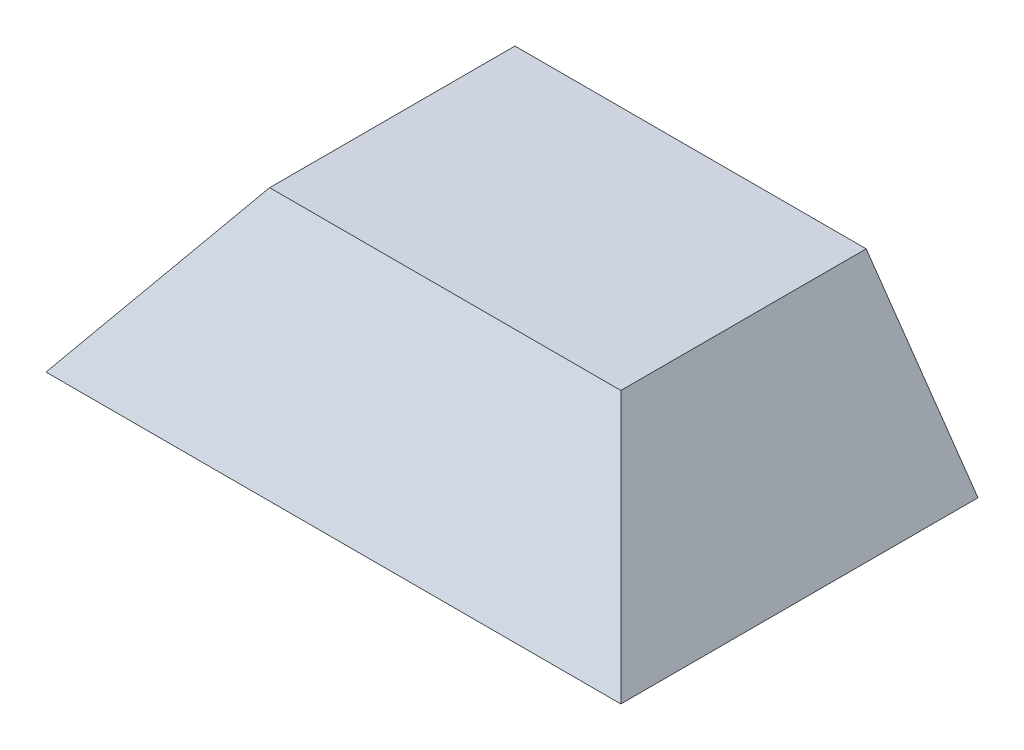
ISO-10303-21;
HEADER;
FILE_DESCRIPTION(('STEP AP214'),'2;1');
FILE_NAME('part.step','',(''),(''),'','','');
FILE_SCHEMA(('AUTOMOTIVE_DESIGN { 1 0 10303 214 1 1 1 1 }'));
ENDSEC;
DATA;
#1=APPLICATION_CONTEXT('core data for automotive mechanical design processes');
#2=APPLICATION_PROTOCOL_DEFINITION('international standard','automotive_design',2000,#1);
#3=PRODUCT_CONTEXT('',#1,'mechanical');
#4=PRODUCT('Part','Part','',(#3));
#5=PRODUCT_RELATED_PRODUCT_CATEGORY('part','',(#4));
#6=PRODUCT_DEFINITION_FORMATION('','',#4);
#7=PRODUCT_DEFINITION_CONTEXT('part definition',#1,'design');
#8=PRODUCT_DEFINITION('design','',#6,#7);
#9=PRODUCT_DEFINITION_SHAPE('','',#8);
#10=(LENGTH_UNIT() NAMED_UNIT(*) SI_UNIT(.MILLI.,.METRE.));
#11=(NAMED_UNIT(*) PLANE_ANGLE_UNIT() SI_UNIT($,.RADIAN.));
#12=(NAMED_UNIT(*) SI_UNIT($,.STERADIAN.) SOLID_ANGLE_UNIT());
#13=UNCERTAINTY_MEASURE_WITH_UNIT(LENGTH_MEASURE(1.E-05),#10,'distance_accuracy_value','');
#14=(GEOMETRIC_REPRESENTATION_CONTEXT(3) GLOBAL_UNCERTAINTY_ASSIGNED_CONTEXT((#13)) GLOBAL_UNIT_ASSIGNED_CONTEXT((#10,
#11,#12)) REPRESENTATION_CONTEXT('',''));
#15=CARTESIAN_POINT('',(0.,0.,0.));
#16=DIRECTION('',(0.,0.,1.));
#17=DIRECTION('',(1.,0.,0.));
#18=AXIS2_PLACEMENT_3D('',#15,#16,#17);
#19=CARTESIAN_POINT('',(-70.,0.,0.));
#20=DIRECTION('',(-1.,0.,0.));
#21=DIRECTION('',(0.,0.,-1.));
#22=AXIS2_PLACEMENT_3D('',#19,#20,#21);
#23=PLANE('',#22);
#24=DIRECTION('',(0.,0.,1.));
#25=VECTOR('',#24,1.);
#26=CARTESIAN_POINT('',(-70.,5.,-8.29628070749418));
#27=LINE('',#26,#25);
#28=CARTESIAN_POINT('',(-70.,5.,-8.29628070749418));
#29=VERTEX_POINT('',#28);
#30=CARTESIAN_POINT('',(-70.,5.,11.7037192925058));
#31=VERTEX_POINT('',#30);
#32=EDGE_CURVE('E238',#29,#31,#27,.T.);
#33=ORIENTED_EDGE('',*,*,#32,.T.);
#34=DIRECTION('',(0.,-1.,0.));
#35=VECTOR('',#34,1.);
#36=CARTESIAN_POINT('',(-70.,0.,11.7037192925058));
#37=LINE('',#36,#35);
#38=CARTESIAN_POINT('',(-70.,0.,11.7037192925058));
#39=VERTEX_POINT('',#38);
#40=EDGE_CURVE('E253',#31,#39,#37,.T.);
#41=ORIENTED_EDGE('',*,*,#40,.T.);
#42=DIRECTION('',(0.,0.,-1.));
#43=VECTOR('',#42,1.);
#44=CARTESIAN_POINT('',(-70.,0.,-8.29628070749418));
#45=LINE('',#44,#43);
#46=CARTESIAN_POINT('',(-70.,0.,-8.29628070749418));
#47=VERTEX_POINT('',#46);
#48=EDGE_CURVE('E257',#39,#47,#45,.T.);
#49=ORIENTED_EDGE('',*,*,#48,.T.);
#50=DIRECTION('',(0.,1.,0.));
#51=VECTOR('',#50,1.);
#52=CARTESIAN_POINT('',(-70.,0.,-8.29628070749418));
#53=LINE('',#52,#51);
#54=EDGE_CURVE('E254',#47,#29,#53,.T.);
#55=ORIENTED_EDGE('',*,*,#54,.T.);
#56=EDGE_LOOP('',(#33,#41,#49,#55));
#57=FACE_BOUND('',#56,.T.);
#58=ADVANCED_FACE('F41',(#57),#23,.F.);
#59=DIRECTION('',(0.,0.,-1.));
#60=VECTOR('',#59,1.);
#61=CARTESIAN_POINT('',(-70.,10.,-8.29628070749418));
#62=LINE('',#61,#60);
#63=CARTESIAN_POINT('',(-70.,10.,11.7037192925058));
#64=VERTEX_POINT('',#63);
#65=CARTESIAN_POINT('',(-70.,10.,-8.29628070749418));
#66=VERTEX_POINT('',#65);
#67=EDGE_CURVE('E582',#64,#66,#62,.T.);
#68=ORIENTED_EDGE('',*,*,#67,.T.);
#69=CARTESIAN_POINT('',(-70.,20.,-8.29628070749418));
#70=VERTEX_POINT('',#69);
#71=EDGE_CURVE('E243',#66,#70,#53,.T.);
#72=ORIENTED_EDGE('',*,*,#71,.T.);
#73=DIRECTION('',(0.,0.,1.));
#74=VECTOR('',#73,1.);
#75=CARTESIAN_POINT('',(-70.,20.,-8.29628070749418));
#76=LINE('',#75,#74);
#77=CARTESIAN_POINT('',(-70.,20.,11.7037192925058));
#78=VERTEX_POINT('',#77);
#79=EDGE_CURVE('E250',#70,#78,#76,.T.);
#80=ORIENTED_EDGE('',*,*,#79,.T.);
#81=EDGE_CURVE('E261',#78,#64,#37,.T.);
#82=ORIENTED_EDGE('',*,*,#81,.T.);
#83=EDGE_LOOP('',(#68,#72,#80,#82));
#84=FACE_BOUND('',#83,.T.);
#85=ADVANCED_FACE('F494',(#84),#23,.F.);
#86=CARTESIAN_POINT('',(-90.002,0.,11.7037192925058));
#87=DIRECTION('',(0.,0.,1.));
#88=DIRECTION('',(1.,0.,0.));
#89=AXIS2_PLACEMENT_3D('',#86,#87,#88);
#90=PLANE('',#89);
#91=ORIENTED_EDGE('',*,*,#40,.F.);
#92=DIRECTION('',(1.,0.,0.));
#93=VECTOR('',#92,1.);
#94=CARTESIAN_POINT('',(-78.,5.,11.7037192925058));
#95=LINE('',#94,#93);
#96=CARTESIAN_POINT('',(-78.,5.,11.7037192925058));
#97=VERTEX_POINT('',#96);
#98=EDGE_CURVE('E245',#97,#31,#95,.T.);
#99=ORIENTED_EDGE('',*,*,#98,.F.);
#100=DIRECTION('',(0.,1.,0.));
#101=VECTOR('',#100,1.);
#102=CARTESIAN_POINT('',(-78.,10.,11.7037192925058));
#103=LINE('',#102,#101);
#104=CARTESIAN_POINT('',(-78.,10.,11.7037192925058));
#105=VERTEX_POINT('',#104);
#106=EDGE_CURVE('E231',#97,#105,#103,.T.);
#107=ORIENTED_EDGE('',*,*,#106,.T.);
#108=DIRECTION('',(1.,0.,0.));
#109=VECTOR('',#108,1.);
#110=CARTESIAN_POINT('',(-78.,10.,11.7037192925058));
#111=LINE('',#110,#109);
#112=EDGE_CURVE('E227',#105,#64,#111,.T.);
#113=ORIENTED_EDGE('',*,*,#112,.T.);
#114=ORIENTED_EDGE('',*,*,#81,.F.);
#115=DIRECTION('',(1.,0.,0.));
#116=VECTOR('',#115,1.);
#117=CARTESIAN_POINT('',(-90.002,20.,11.7037192925058));
#118=LINE('',#117,#116);
#119=CARTESIAN_POINT('',(-71.1127508807601,20.,11.7037192925058));
#120=VERTEX_POINT('',#119);
#121=EDGE_CURVE('E265',#120,#78,#118,.T.);
#122=ORIENTED_EDGE('',*,*,#121,.F.);
#123=DIRECTION('',(-0.573576436351041,-0.819152044288995,0.));
#124=VECTOR('',#123,1.);
#125=CARTESIAN_POINT('',(-86.7240498027007,-2.29524543802495,11.7037192925058));
#126=LINE('',#125,#124);
#127=CARTESIAN_POINT('',(-85.1169016449542,0.,11.7037192925058));
#128=VERTEX_POINT('',#127);
#129=EDGE_CURVE('E272',#120,#128,#126,.T.);
#130=ORIENTED_EDGE('',*,*,#129,.T.);
#131=DIRECTION('',(1.,0.,0.));
#132=VECTOR('',#131,1.);
#133=CARTESIAN_POINT('',(-90.002,0.,11.7037192925058));
#134=LINE('',#133,#132);
#135=EDGE_CURVE('E64',#128,#39,#134,.T.);
#136=ORIENTED_EDGE('',*,*,#135,.T.);
#137=EDGE_LOOP('',(#91,#99,#107,#113,#114,#122,#130,#136));
#138=FACE_BOUND('',#137,.T.);
#139=ADVANCED_FACE('F500',(#138),#90,.T.);
#140=CARTESIAN_POINT('',(-90.002,0.,-8.29628070749418));
#141=DIRECTION('',(0.,0.,-1.));
#142=DIRECTION('',(-1.,0.,0.));
#143=AXIS2_PLACEMENT_3D('',#140,#141,#142);
#144=PLANE('',#143);
#145=DIRECTION('',(0.,-1.,0.));
#146=VECTOR('',#145,1.);
#147=CARTESIAN_POINT('',(-78.,10.,-8.29628070749418));
#148=LINE('',#147,#146);
#149=CARTESIAN_POINT('',(-78.,10.,-8.29628070749418));
#150=VERTEX_POINT('',#149);
#151=CARTESIAN_POINT('',(-78.,5.,-8.29628070749418));
#152=VERTEX_POINT('',#151);
#153=EDGE_CURVE('E232',#150,#152,#148,.T.);
#154=ORIENTED_EDGE('',*,*,#153,.T.);
#155=DIRECTION('',(1.,0.,0.));
#156=VECTOR('',#155,1.);
#157=CARTESIAN_POINT('',(-78.,5.,-8.29628070749418));
#158=LINE('',#157,#156);
#159=EDGE_CURVE('E56',#152,#29,#158,.T.);
#160=ORIENTED_EDGE('',*,*,#159,.T.);
#161=ORIENTED_EDGE('',*,*,#54,.F.);
#162=DIRECTION('',(1.,0.,0.));
#163=VECTOR('',#162,1.);
#164=CARTESIAN_POINT('',(-90.002,0.,-8.29628070749418));
#165=LINE('',#164,#163);
#166=CARTESIAN_POINT('',(-85.1169016449542,0.,-8.29628070749418));
#167=VERTEX_POINT('',#166);
#168=EDGE_CURVE('E268',#167,#47,#165,.T.);
#169=ORIENTED_EDGE('',*,*,#168,.F.);
#170=DIRECTION('',(0.573576436351041,0.819152044288995,0.));
#171=VECTOR('',#170,1.);
#172=CARTESIAN_POINT('',(-86.7240498027006,-2.29524543802495,-8.29628070749418));
#173=LINE('',#172,#171);
#174=CARTESIAN_POINT('',(-71.1127508807601,20.,-8.29628070749418));
#175=VERTEX_POINT('',#174);
#176=EDGE_CURVE('E274',#167,#175,#173,.T.);
#177=ORIENTED_EDGE('',*,*,#176,.T.);
#178=DIRECTION('',(1.,0.,0.));
#179=VECTOR('',#178,1.);
#180=CARTESIAN_POINT('',(-90.002,20.,-8.29628070749418));
#181=LINE('',#180,#179);
#182=EDGE_CURVE('E260',#175,#70,#181,.T.);
#183=ORIENTED_EDGE('',*,*,#182,.T.);
#184=ORIENTED_EDGE('',*,*,#71,.F.);
#185=DIRECTION('',(1.,0.,0.));
#186=VECTOR('',#185,1.);
#187=CARTESIAN_POINT('',(-78.,10.,-8.29628070749418));
#188=LINE('',#187,#186);
#189=EDGE_CURVE('E224',#150,#66,#188,.T.);
#190=ORIENTED_EDGE('',*,*,#189,.F.);
#191=EDGE_LOOP('',(#154,#160,#161,#169,#177,#183,#184,#190));
#192=FACE_BOUND('',#191,.T.);
#193=ADVANCED_FACE('F241',(#192),#144,.T.);
#194=CARTESIAN_POINT('',(70.,0.,0.));
#195=DIRECTION('',(1.,0.,0.));
#196=DIRECTION('',(0.,0.,-1.));
#197=AXIS2_PLACEMENT_3D('',#194,#195,#196);
#198=PLANE('',#197);
#199=DIRECTION('',(0.,1.,0.));
#200=VECTOR('',#199,1.);
#201=CARTESIAN_POINT('',(70.,0.,-8.29628070749418));
#202=LINE('',#201,#200);
#203=CARTESIAN_POINT('',(70.,10.,-8.29628070749418));
#204=VERTEX_POINT('',#203);
#205=CARTESIAN_POINT('',(70.,20.,-8.29628070749418));
#206=VERTEX_POINT('',#205);
#207=EDGE_CURVE('E300',#204,#206,#202,.T.);
#208=ORIENTED_EDGE('',*,*,#207,.F.);
#209=DIRECTION('',(0.,0.,-1.));
#210=VECTOR('',#209,1.);
#211=CARTESIAN_POINT('',(70.,10.,-8.29628070749418));
#212=LINE('',#211,#210);
#213=CARTESIAN_POINT('',(70.,10.,11.7037192925058));
#214=VERTEX_POINT('',#213);
#215=EDGE_CURVE('E287',#214,#204,#212,.T.);
#216=ORIENTED_EDGE('',*,*,#215,.F.);
#217=DIRECTION('',(0.,-1.,0.));
#218=VECTOR('',#217,1.);
#219=CARTESIAN_POINT('',(70.,0.,11.7037192925058));
#220=LINE('',#219,#218);
#221=CARTESIAN_POINT('',(70.,20.,11.7037192925058));
#222=VERTEX_POINT('',#221);
#223=EDGE_CURVE('E318',#222,#214,#220,.T.);
#224=ORIENTED_EDGE('',*,*,#223,.F.);
#225=DIRECTION('',(0.,0.,1.));
#226=VECTOR('',#225,1.);
#227=CARTESIAN_POINT('',(70.,20.,-8.29628070749418));
#228=LINE('',#227,#226);
#229=EDGE_CURVE('E307',#206,#222,#228,.T.);
#230=ORIENTED_EDGE('',*,*,#229,.F.);
#231=EDGE_LOOP('',(#208,#216,#224,#230));
#232=FACE_BOUND('',#231,.T.);
#233=ADVANCED_FACE('F482',(#232),#198,.F.);
#234=CARTESIAN_POINT('',(86.723391822844,-2.29430574540416,-64.666));
#235=DIRECTION('',(-0.819152044288995,-0.573576436351041,0.));
#236=DIRECTION('',(0.573576436351041,-0.819152044288995,0.));
#237=AXIS2_PLACEMENT_3D('',#234,#235,#236);
#238=PLANE('',#237);
#239=DIRECTION('',(0.573576436351041,-0.819152044288995,0.));
#240=VECTOR('',#239,1.);
#241=CARTESIAN_POINT('',(86.723391822844,-2.29430574540416,0.));
#242=LINE('',#241,#240);
#243=CARTESIAN_POINT('',(52.9073548873079,46.,0.));
#244=VERTEX_POINT('',#243);
#245=CARTESIAN_POINT('',(71.1127508807601,20.,0.));
#246=VERTEX_POINT('',#245);
#247=EDGE_CURVE('E375',#244,#246,#242,.T.);
#248=ORIENTED_EDGE('',*,*,#247,.T.);
#249=DIRECTION('',(0.,0.,-1.));
#250=VECTOR('',#249,1.);
#251=CARTESIAN_POINT('',(71.1127508807601,20.,-8.29628070749418));
#252=LINE('',#251,#250);
#253=CARTESIAN_POINT('',(71.1127508807601,20.,11.7037192925058));
#254=VERTEX_POINT('',#253);
#255=EDGE_CURVE('E333',#254,#246,#252,.T.);
#256=ORIENTED_EDGE('',*,*,#255,.F.);
#257=DIRECTION('',(-0.573576436351041,0.819152044288995,0.));
#258=VECTOR('',#257,1.);
#259=CARTESIAN_POINT('',(86.7240498027007,-2.29524543802498,11.7037192925058));
#260=LINE('',#259,#258);
#261=CARTESIAN_POINT('',(85.1169016449542,0.,11.7037192925058));
#262=VERTEX_POINT('',#261);
#263=EDGE_CURVE('E324',#262,#254,#260,.T.);
#264=ORIENTED_EDGE('',*,*,#263,.F.);
#265=DIRECTION('',(0.,0.,-1.));
#266=VECTOR('',#265,1.);
#267=CARTESIAN_POINT('',(85.1169016449542,0.,-64.666));
#268=LINE('',#267,#266);
#269=CARTESIAN_POINT('',(85.1169016449542,0.,59.7819016449542));
#270=VERTEX_POINT('',#269);
#271=EDGE_CURVE('E392',#270,#262,#268,.T.);
#272=ORIENTED_EDGE('',*,*,#271,.F.);
#273=DIRECTION('',(0.49754281216452,-0.710564775461634,0.49754281216452));
#274=VECTOR('',#273,1.);
#275=CARTESIAN_POINT('',(87.5347599576417,-3.45305952984959,62.1997599576417));
#276=LINE('',#275,#274);
#277=CARTESIAN_POINT('',(52.9073548873079,46.,27.5723548873079));
#278=VERTEX_POINT('',#277);
#279=EDGE_CURVE('E381',#278,#270,#276,.T.);
#280=ORIENTED_EDGE('',*,*,#279,.F.);
#281=DIRECTION('',(0.,0.,1.));
#282=VECTOR('',#281,1.);
#283=CARTESIAN_POINT('',(52.9073548873079,46.,0.));
#284=LINE('',#283,#282);
#285=EDGE_CURVE('E385',#244,#278,#284,.T.);
#286=ORIENTED_EDGE('',*,*,#285,.F.);
#287=EDGE_LOOP('',(#248,#256,#264,#272,#280,#286));
#288=FACE_BOUND('',#287,.T.);
#289=ADVANCED_FACE('F480',(#288),#238,.T.);
#290=CARTESIAN_POINT('',(0.,0.,0.));
#291=DIRECTION('',(0.,0.,1.));
#292=DIRECTION('',(1.,0.,0.));
#293=AXIS2_PLACEMENT_3D('',#290,#291,#292);
#294=PLANE('',#293);
#295=DIRECTION('',(-1.,0.,0.));
#296=VECTOR('',#295,1.);
#297=CARTESIAN_POINT('',(90.002,20.,0.));
#298=LINE('',#297,#296);
#299=CARTESIAN_POINT('',(71.1364284841101,20.,0.));
#300=VERTEX_POINT('',#299);
#301=EDGE_CURVE('E337',#300,#246,#298,.T.);
#302=ORIENTED_EDGE('',*,*,#301,.T.);
#303=ORIENTED_EDGE('',*,*,#247,.F.);
#304=DIRECTION('',(-1.,0.,0.));
#305=VECTOR('',#304,1.);
#306=CARTESIAN_POINT('',(0.,46.,0.));
#307=LINE('',#306,#305);
#308=CARTESIAN_POINT('',(-52.9073548873079,46.,0.));
#309=VERTEX_POINT('',#308);
#310=EDGE_CURVE('E369',#244,#309,#307,.T.);
#311=ORIENTED_EDGE('',*,*,#310,.T.);
#312=DIRECTION('',(-0.573576436351041,-0.819152044288995,0.));
#313=VECTOR('',#312,1.);
#314=CARTESIAN_POINT('',(-85.1169016449542,0.,0.));
#315=LINE('',#314,#313);
#316=CARTESIAN_POINT('',(-52.8799125800155,46.0391916764601,0.));
#317=VERTEX_POINT('',#316);
#318=EDGE_CURVE('E363',#317,#309,#315,.T.);
#319=ORIENTED_EDGE('',*,*,#318,.F.);
#320=DIRECTION('',(-1.,0.,0.));
#321=VECTOR('',#320,1.);
#322=CARTESIAN_POINT('',(-52.8799125800155,46.0391916764601,0.));
#323=LINE('',#322,#321);
#324=CARTESIAN_POINT('',(52.9344174659689,46.0391916764601,0.));
#325=VERTEX_POINT('',#324);
#326=EDGE_CURVE('E360',#325,#317,#323,.T.);
#327=ORIENTED_EDGE('',*,*,#326,.F.);
#328=DIRECTION('',(-0.572925162497542,0.819607685528366,0.));
#329=VECTOR('',#328,1.);
#330=CARTESIAN_POINT('',(52.9344174659689,46.0391916764601,0.));
#331=LINE('',#330,#329);
#332=EDGE_CURVE('E358',#300,#325,#331,.T.);
#333=ORIENTED_EDGE('',*,*,#332,.F.);
#334=EDGE_LOOP('',(#302,#303,#311,#319,#327,#333));
#335=FACE_BOUND('',#334,.T.);
#336=ADVANCED_FACE('F441',(#335),#294,.F.);
#337=CARTESIAN_POINT('',(52.9344174659689,46.0391916764601,-278.925746661805));
#338=DIRECTION('',(0.819607685528366,0.572925162497542,0.));
#339=DIRECTION('',(-0.572925162497542,0.819607685528366,0.));
#340=AXIS2_PLACEMENT_3D('',#337,#338,#339);
#341=PLANE('',#340);
#342=DIRECTION('',(0.,0.,1.));
#343=VECTOR('',#342,1.);
#344=CARTESIAN_POINT('',(71.1364284841101,20.,-8.29628070749418));
#345=LINE('',#344,#343);
#346=CARTESIAN_POINT('',(71.1364284841101,20.,-8.29628070749416));
#347=VERTEX_POINT('',#346);
#348=EDGE_CURVE('E340',#347,#300,#345,.T.);
#349=ORIENTED_EDGE('',*,*,#348,.T.);
#350=ORIENTED_EDGE('',*,*,#332,.T.);
#351=DIRECTION('',(0.,0.,1.));
#352=VECTOR('',#351,1.);
#353=CARTESIAN_POINT('',(52.9344174659689,46.0391916764601,-278.925746661805));
#354=LINE('',#353,#352);
#355=CARTESIAN_POINT('',(52.9344174659689,46.0391916764601,-47.1598115447574));
#356=VERTEX_POINT('',#355);
#357=EDGE_CURVE('E370',#356,#325,#354,.T.);
#358=ORIENTED_EDGE('',*,*,#357,.F.);
#359=DIRECTION('',(0.572925162497542,-0.819607685528366,0.));
#360=VECTOR('',#359,1.);
#361=CARTESIAN_POINT('',(52.9344174659689,46.0391916764601,-47.1598115447574));
#362=LINE('',#361,#360);
#363=CARTESIAN_POINT('',(85.1169016449541,0.,-47.1598115447574));
#364=VERTEX_POINT('',#363);
#365=EDGE_CURVE('E350',#356,#364,#362,.T.);
#366=ORIENTED_EDGE('',*,*,#365,.T.);
#367=DIRECTION('',(0.,0.,1.));
#368=VECTOR('',#367,1.);
#369=CARTESIAN_POINT('',(85.1169016449542,0.,-278.925746661805));
#370=LINE('',#369,#368);
#371=CARTESIAN_POINT('',(85.1169016449542,0.,-8.29628070749422));
#372=VERTEX_POINT('',#371);
#373=EDGE_CURVE('E366',#364,#372,#370,.T.);
#374=ORIENTED_EDGE('',*,*,#373,.T.);
#375=DIRECTION('',(-0.572925162497542,0.819607685528366,0.));
#376=VECTOR('',#375,1.);
#377=CARTESIAN_POINT('',(86.7204021656378,-2.29391452239925,-8.29628070749418));
#378=LINE('',#377,#376);
#379=EDGE_CURVE('E336',#372,#347,#378,.T.);
#380=ORIENTED_EDGE('',*,*,#379,.T.);
#381=EDGE_LOOP('',(#349,#350,#358,#366,#374,#380));
#382=FACE_BOUND('',#381,.T.);
#383=ADVANCED_FACE('F432',(#382),#341,.F.);
#384=CARTESIAN_POINT('',(0.,46.,0.));
#385=DIRECTION('',(0.,1.,0.));
#386=DIRECTION('',(0.,0.,1.));
#387=AXIS2_PLACEMENT_3D('',#384,#385,#386);
#388=PLANE('',#387);
#389=ORIENTED_EDGE('',*,*,#310,.F.);
#390=ORIENTED_EDGE('',*,*,#285,.T.);
#391=DIRECTION('',(-1.,0.,0.));
#392=VECTOR('',#391,1.);
#393=CARTESIAN_POINT('',(90.001,46.,27.5723548873079));
#394=LINE('',#393,#392);
#395=CARTESIAN_POINT('',(-52.9073548873079,46.,27.5723548873079));
#396=VERTEX_POINT('',#395);
#397=EDGE_CURVE('E382',#278,#396,#394,.T.);
#398=ORIENTED_EDGE('',*,*,#397,.T.);
#399=DIRECTION('',(0.,0.,1.));
#400=VECTOR('',#399,1.);
#401=CARTESIAN_POINT('',(-52.9073548873079,46.,0.));
#402=LINE('',#401,#400);
#403=EDGE_CURVE('E379',#309,#396,#402,.T.);
#404=ORIENTED_EDGE('',*,*,#403,.F.);
#405=EDGE_LOOP('',(#389,#390,#398,#404));
#406=FACE_BOUND('',#405,.T.);
#407=ADVANCED_FACE('F450',(#406),#388,.F.);
#408=CARTESIAN_POINT('',(-86.723391822844,-2.29430574540416,-64.666));
#409=DIRECTION('',(-0.819152044288995,0.573576436351041,0.));
#410=DIRECTION('',(-0.573576436351041,-0.819152044288995,0.));
#411=AXIS2_PLACEMENT_3D('',#408,#409,#410);
#412=PLANE('',#411);
#413=DIRECTION('',(0.,0.,1.));
#414=VECTOR('',#413,1.);
#415=CARTESIAN_POINT('',(-85.1169016449542,0.,0.));
#416=LINE('',#415,#414);
#417=CARTESIAN_POINT('',(-85.1169016449542,0.,59.7819016449542));
#418=VERTEX_POINT('',#417);
#419=EDGE_CURVE('E387',#128,#418,#416,.T.);
#420=ORIENTED_EDGE('',*,*,#419,.F.);
#421=ORIENTED_EDGE('',*,*,#129,.F.);
#422=DIRECTION('',(0.,0.,1.));
#423=VECTOR('',#422,1.);
#424=CARTESIAN_POINT('',(-71.1127508807601,20.,-8.29628070749418));
#425=LINE('',#424,#423);
#426=EDGE_CURVE('E270',#175,#120,#425,.T.);
#427=ORIENTED_EDGE('',*,*,#426,.F.);
#428=ORIENTED_EDGE('',*,*,#176,.F.);
#429=CARTESIAN_POINT('',(-85.1169016449542,0.,-47.1598115447574));
#430=VERTEX_POINT('',#429);
#431=EDGE_CURVE('E399',#430,#167,#416,.T.);
#432=ORIENTED_EDGE('',*,*,#431,.F.);
#433=DIRECTION('',(0.573576436351041,0.819152044288995,0.));
#434=VECTOR('',#433,1.);
#435=CARTESIAN_POINT('',(-86.723391822844,-2.29430574540416,-47.1598115447574));
#436=LINE('',#435,#434);
#437=CARTESIAN_POINT('',(-52.8799125800155,46.0391916764601,-47.1598115447574));
#438=VERTEX_POINT('',#437);
#439=EDGE_CURVE('E346',#430,#438,#436,.T.);
#440=ORIENTED_EDGE('',*,*,#439,.T.);
#441=DIRECTION('',(0.,0.,1.));
#442=VECTOR('',#441,1.);
#443=CARTESIAN_POINT('',(-52.8799125800155,46.0391916764601,-278.925746661805));
#444=LINE('',#443,#442);
#445=EDGE_CURVE('E367',#438,#317,#444,.T.);
#446=ORIENTED_EDGE('',*,*,#445,.T.);
#447=ORIENTED_EDGE('',*,*,#318,.T.);
#448=ORIENTED_EDGE('',*,*,#403,.T.);
#449=DIRECTION('',(0.49754281216452,0.710564775461634,-0.49754281216452));
#450=VECTOR('',#449,1.);
#451=CARTESIAN_POINT('',(-55.5187720976441,42.2705097162863,30.1837720976441));
#452=LINE('',#451,#450);
#453=EDGE_CURVE('E378',#418,#396,#452,.T.);
#454=ORIENTED_EDGE('',*,*,#453,.F.);
#455=EDGE_LOOP('',(#420,#421,#427,#428,#432,#440,#446,#447,#448,#454));
#456=FACE_BOUND('',#455,.T.);
#457=ADVANCED_FACE('F447',(#456),#412,.F.);
#458=CARTESIAN_POINT('',(0.,50.,0.));
#459=DIRECTION('',(0.,1.,0.));
#460=DIRECTION('',(0.,0.,1.));
#461=AXIS2_PLACEMENT_3D('',#458,#459,#460);
#462=PLANE('',#461);
#463=DIRECTION('',(1.,0.,0.));
#464=VECTOR('',#463,1.);
#465=CARTESIAN_POINT('',(-90.,50.,-47.1598115447574));
#466=LINE('',#465,#464);
#467=CARTESIAN_POINT('',(-54.9896230895149,50.,-47.1598115447574));
#468=VERTEX_POINT('',#467);
#469=CARTESIAN_POINT('',(54.9896230895149,50.,-47.1598115447574));
#470=VERTEX_POINT('',#469);
#471=EDGE_CURVE('E339',#468,#470,#466,.T.);
#472=ORIENTED_EDGE('',*,*,#471,.F.);
#473=DIRECTION('',(0.,0.,1.));
#474=VECTOR('',#473,1.);
#475=CARTESIAN_POINT('',(-54.9896230895149,50.,-64.666));
#476=LINE('',#475,#474);
#477=CARTESIAN_POINT('',(-54.9896230895149,50.,29.6546230895149));
#478=VERTEX_POINT('',#477);
#479=EDGE_CURVE('E404',#468,#478,#476,.T.);
#480=ORIENTED_EDGE('',*,*,#479,.T.);
#481=DIRECTION('',(-1.,0.,0.));
#482=VECTOR('',#481,1.);
#483=CARTESIAN_POINT('',(90.001,50.,29.6546230895149));
#484=LINE('',#483,#482);
#485=CARTESIAN_POINT('',(54.9896230895149,50.,29.6546230895149));
#486=VERTEX_POINT('',#485);
#487=EDGE_CURVE('E409',#486,#478,#484,.T.);
#488=ORIENTED_EDGE('',*,*,#487,.F.);
#489=DIRECTION('',(0.,0.,1.));
#490=VECTOR('',#489,1.);
#491=CARTESIAN_POINT('',(54.9896230895149,50.,-64.666));
#492=LINE('',#491,#490);
#493=EDGE_CURVE('E412',#470,#486,#492,.T.);
#494=ORIENTED_EDGE('',*,*,#493,.F.);
#495=EDGE_LOOP('',(#472,#480,#488,#494));
#496=FACE_BOUND('',#495,.T.);
#497=ADVANCED_FACE('F562',(#496),#462,.T.);
#498=CARTESIAN_POINT('',(90.001,0.,64.665));
#499=DIRECTION('',(0.,0.573576436351041,0.819152044288995));
#500=DIRECTION('',(0.,-0.819152044288995,0.573576436351041));
#501=AXIS2_PLACEMENT_3D('',#498,#499,#500);
#502=PLANE('',#501);
#503=ORIENTED_EDGE('',*,*,#487,.T.);
#504=DIRECTION('',(0.49754281216452,0.710564775461634,-0.49754281216452));
#505=VECTOR('',#504,1.);
#506=CARTESIAN_POINT('',(-57.9842596888523,45.7232157097393,32.6492596888523));
#507=LINE('',#506,#505);
#508=CARTESIAN_POINT('',(-90.,0.,64.665));
#509=VERTEX_POINT('',#508);
#510=EDGE_CURVE('E395',#509,#478,#507,.T.);
#511=ORIENTED_EDGE('',*,*,#510,.F.);
#512=DIRECTION('',(1.,0.,0.));
#513=VECTOR('',#512,1.);
#514=CARTESIAN_POINT('',(90.,0.,64.665));
#515=LINE('',#514,#513);
#516=CARTESIAN_POINT('',(90.,0.,64.665));
#517=VERTEX_POINT('',#516);
#518=EDGE_CURVE('E416',#509,#517,#515,.T.);
#519=ORIENTED_EDGE('',*,*,#518,.T.);
#520=DIRECTION('',(0.49754281216452,-0.710564775461634,0.49754281216452));
#521=VECTOR('',#520,1.);
#522=CARTESIAN_POINT('',(90.0002475488499,-0.000353536396628211,64.6652475488499));
#523=LINE('',#522,#521);
#524=EDGE_CURVE('E406',#486,#517,#523,.T.);
#525=ORIENTED_EDGE('',*,*,#524,.F.);
#526=EDGE_LOOP('',(#503,#511,#519,#525));
#527=FACE_BOUND('',#526,.T.);
#528=ADVANCED_FACE('F559',(#527),#502,.T.);
#529=CARTESIAN_POINT('',(90.,0.,-64.666));
#530=DIRECTION('',(-0.819152044288995,-0.573576436351041,0.));
#531=DIRECTION('',(0.573576436351041,-0.819152044288995,0.));
#532=AXIS2_PLACEMENT_3D('',#529,#530,#531);
#533=PLANE('',#532);
#534=DIRECTION('',(0.,0.,-1.));
#535=VECTOR('',#534,1.);
#536=CARTESIAN_POINT('',(90.,0.,64.665));
#537=LINE('',#536,#535);
#538=CARTESIAN_POINT('',(90.,0.,-47.1598115447574));
#539=VERTEX_POINT('',#538);
#540=EDGE_CURVE('E49',#517,#539,#537,.T.);
#541=ORIENTED_EDGE('',*,*,#540,.T.);
#542=DIRECTION('',(-0.573576436351041,0.819152044288995,0.));
#543=VECTOR('',#542,1.);
#544=CARTESIAN_POINT('',(90.,0.,-47.1598115447574));
#545=LINE('',#544,#543);
#546=EDGE_CURVE('E353',#539,#470,#545,.T.);
#547=ORIENTED_EDGE('',*,*,#546,.T.);
#548=ORIENTED_EDGE('',*,*,#493,.T.);
#549=ORIENTED_EDGE('',*,*,#524,.T.);
#550=EDGE_LOOP('',(#541,#547,#548,#549));
#551=FACE_BOUND('',#550,.T.);
#552=ADVANCED_FACE('F420',(#551),#533,.F.);
#553=CARTESIAN_POINT('',(0.,0.,0.));
#554=DIRECTION('',(0.,1.,0.));
#555=DIRECTION('',(0.,0.,1.));
#556=AXIS2_PLACEMENT_3D('',#553,#554,#555);
#557=PLANE('',#556);
#558=CARTESIAN_POINT('',(-74.,0.,1.70371929250581));
#559=DIRECTION('',(0.,1.,0.));
#560=DIRECTION('',(0.,0.,1.));
#561=AXIS2_PLACEMENT_3D('',#558,#559,#560);
#562=CIRCLE('',#561,1.585);
#563=CARTESIAN_POINT('',(-74.,0.,3.28871929250581));
#564=VERTEX_POINT('',#563);
#565=EDGE_CURVE('E589',#564,#564,#562,.T.);
#566=ORIENTED_EDGE('',*,*,#565,.T.);
#567=EDGE_LOOP('',(#566));
#568=FACE_BOUND('',#567,.T.);
#569=CARTESIAN_POINT('',(74.,0.,1.70371929250581));
#570=DIRECTION('',(0.,1.,0.));
#571=DIRECTION('',(0.,0.,1.));
#572=AXIS2_PLACEMENT_3D('',#569,#570,#571);
#573=CIRCLE('',#572,1.585);
#574=CARTESIAN_POINT('',(74.,0.,3.28871929250581));
#575=VERTEX_POINT('',#574);
#576=EDGE_CURVE('E279',#575,#575,#573,.F.);
#577=ORIENTED_EDGE('',*,*,#576,.F.);
#578=EDGE_LOOP('',(#577));
#579=FACE_BOUND('',#578,.T.);
#580=ORIENTED_EDGE('',*,*,#271,.T.);
#581=DIRECTION('',(-1.,0.,0.));
#582=VECTOR('',#581,1.);
#583=CARTESIAN_POINT('',(90.002,0.,11.7037192925058));
#584=LINE('',#583,#582);
#585=CARTESIAN_POINT('',(70.,0.,11.7037192925058));
#586=VERTEX_POINT('',#585);
#587=EDGE_CURVE('E327',#262,#586,#584,.T.);
#588=ORIENTED_EDGE('',*,*,#587,.T.);
#589=DIRECTION('',(0.,0.,-1.));
#590=VECTOR('',#589,1.);
#591=CARTESIAN_POINT('',(70.,0.,-8.29628070749418));
#592=LINE('',#591,#590);
#593=CARTESIAN_POINT('',(70.,0.,-8.29628070749418));
#594=VERTEX_POINT('',#593);
#595=EDGE_CURVE('E314',#586,#594,#592,.T.);
#596=ORIENTED_EDGE('',*,*,#595,.T.);
#597=DIRECTION('',(-1.,0.,0.));
#598=VECTOR('',#597,1.);
#599=CARTESIAN_POINT('',(90.002,0.,-8.29628070749418));
#600=LINE('',#599,#598);
#601=EDGE_CURVE('E317',#372,#594,#600,.T.);
#602=ORIENTED_EDGE('',*,*,#601,.F.);
#603=ORIENTED_EDGE('',*,*,#373,.F.);
#604=DIRECTION('',(1.,0.,0.));
#605=VECTOR('',#604,1.);
#606=CARTESIAN_POINT('',(-90.,0.,-47.1598115447574));
#607=LINE('',#606,#605);
#608=EDGE_CURVE('E347',#364,#539,#607,.T.);
#609=ORIENTED_EDGE('',*,*,#608,.T.);
#610=ORIENTED_EDGE('',*,*,#540,.F.);
#611=ORIENTED_EDGE('',*,*,#518,.F.);
#612=DIRECTION('',(0.,0.,1.));
#613=VECTOR('',#612,1.);
#614=CARTESIAN_POINT('',(-90.,0.,64.665));
#615=LINE('',#614,#613);
#616=CARTESIAN_POINT('',(-90.,0.,-47.1598115447574));
#617=VERTEX_POINT('',#616);
#618=EDGE_CURVE('E414',#617,#509,#615,.T.);
#619=ORIENTED_EDGE('',*,*,#618,.F.);
#620=EDGE_CURVE('E343',#617,#430,#607,.T.);
#621=ORIENTED_EDGE('',*,*,#620,.T.);
#622=ORIENTED_EDGE('',*,*,#431,.T.);
#623=ORIENTED_EDGE('',*,*,#168,.T.);
#624=ORIENTED_EDGE('',*,*,#48,.F.);
#625=ORIENTED_EDGE('',*,*,#135,.F.);
#626=ORIENTED_EDGE('',*,*,#419,.T.);
#627=DIRECTION('',(1.,0.,0.));
#628=VECTOR('',#627,1.);
#629=CARTESIAN_POINT('',(0.,0.,59.7819016449542));
#630=LINE('',#629,#628);
#631=EDGE_CURVE('E396',#418,#270,#630,.T.);
#632=ORIENTED_EDGE('',*,*,#631,.T.);
#633=EDGE_LOOP('',(#580,#588,#596,#602,#603,#609,#610,#611,#619,#621,#622,#623,#624,#625,#626,#632));
#634=FACE_BOUND('',#633,.T.);
#635=ADVANCED_FACE('F43',(#568,#579,#634),#557,.F.);
#636=CARTESIAN_POINT('',(-90.,0.,-64.666));
#637=DIRECTION('',(-0.819152044288995,0.573576436351041,0.));
#638=DIRECTION('',(-0.573576436351041,-0.819152044288995,0.));
#639=AXIS2_PLACEMENT_3D('',#636,#637,#638);
#640=PLANE('',#639);
#641=DIRECTION('',(0.573576436351041,0.819152044288995,0.));
#642=VECTOR('',#641,1.);
#643=CARTESIAN_POINT('',(-90.,0.,-47.1598115447574));
#644=LINE('',#643,#642);
#645=EDGE_CURVE('E355',#617,#468,#644,.T.);
#646=ORIENTED_EDGE('',*,*,#645,.F.);
#647=ORIENTED_EDGE('',*,*,#618,.T.);
#648=ORIENTED_EDGE('',*,*,#510,.T.);
#649=ORIENTED_EDGE('',*,*,#479,.F.);
#650=EDGE_LOOP('',(#646,#647,#648,#649));
#651=FACE_BOUND('',#650,.T.);
#652=ADVANCED_FACE('F547',(#651),#640,.T.);
#653=CARTESIAN_POINT('',(90.001,-2.29430574540417,61.388391822844));
#654=DIRECTION('',(0.,0.573576436351041,0.819152044288995));
#655=DIRECTION('',(0.,-0.819152044288995,0.573576436351041));
#656=AXIS2_PLACEMENT_3D('',#653,#654,#655);
#657=PLANE('',#656);
#658=ORIENTED_EDGE('',*,*,#397,.F.);
#659=ORIENTED_EDGE('',*,*,#279,.T.);
#660=ORIENTED_EDGE('',*,*,#631,.F.);
#661=ORIENTED_EDGE('',*,*,#453,.T.);
#662=EDGE_LOOP('',(#658,#659,#660,#661));
#663=FACE_BOUND('',#662,.T.);
#664=ADVANCED_FACE('F455',(#663),#657,.F.);
#665=CARTESIAN_POINT('',(-52.8799125800155,46.0391916764601,-278.925746661805));
#666=DIRECTION('',(0.,1.,0.));
#667=DIRECTION('',(0.,0.,1.));
#668=AXIS2_PLACEMENT_3D('',#665,#666,#667);
#669=PLANE('',#668);
#670=ORIENTED_EDGE('',*,*,#445,.F.);
#671=DIRECTION('',(1.,0.,0.));
#672=VECTOR('',#671,1.);
#673=CARTESIAN_POINT('',(-52.8799125800155,46.0391916764601,-47.1598115447574));
#674=LINE('',#673,#672);
#675=EDGE_CURVE('E12',#438,#356,#674,.T.);
#676=ORIENTED_EDGE('',*,*,#675,.T.);
#677=ORIENTED_EDGE('',*,*,#357,.T.);
#678=ORIENTED_EDGE('',*,*,#326,.T.);
#679=EDGE_LOOP('',(#670,#676,#677,#678));
#680=FACE_BOUND('',#679,.T.);
#681=ADVANCED_FACE('F438',(#680),#669,.F.);
#682=CARTESIAN_POINT('',(-90.,0.,-47.1598115447574));
#683=DIRECTION('',(0.,0.,1.));
#684=DIRECTION('',(1.,0.,0.));
#685=AXIS2_PLACEMENT_3D('',#682,#683,#684);
#686=PLANE('',#685);
#687=ORIENTED_EDGE('',*,*,#645,.T.);
#688=ORIENTED_EDGE('',*,*,#471,.T.);
#689=ORIENTED_EDGE('',*,*,#546,.F.);
#690=ORIENTED_EDGE('',*,*,#608,.F.);
#691=ORIENTED_EDGE('',*,*,#365,.F.);
#692=ORIENTED_EDGE('',*,*,#675,.F.);
#693=ORIENTED_EDGE('',*,*,#439,.F.);
#694=ORIENTED_EDGE('',*,*,#620,.F.);
#695=EDGE_LOOP('',(#687,#688,#689,#690,#691,#692,#693,#694));
#696=FACE_BOUND('',#695,.T.);
#697=ADVANCED_FACE('F428',(#696),#686,.F.);
#698=CARTESIAN_POINT('',(90.002,20.,-8.29628070749418));
#699=DIRECTION('',(0.,-1.,0.));
#700=DIRECTION('',(0.,0.,-1.));
#701=AXIS2_PLACEMENT_3D('',#698,#699,#700);
#702=PLANE('',#701);
#703=ORIENTED_EDGE('',*,*,#348,.F.);
#704=DIRECTION('',(-1.,0.,0.));
#705=VECTOR('',#704,1.);
#706=CARTESIAN_POINT('',(90.002,20.,-8.29628070749418));
#707=LINE('',#706,#705);
#708=EDGE_CURVE('E321',#347,#206,#707,.T.);
#709=ORIENTED_EDGE('',*,*,#708,.T.);
#710=ORIENTED_EDGE('',*,*,#229,.T.);
#711=DIRECTION('',(-1.,0.,0.));
#712=VECTOR('',#711,1.);
#713=CARTESIAN_POINT('',(90.002,20.,11.7037192925058));
#714=LINE('',#713,#712);
#715=EDGE_CURVE('E325',#254,#222,#714,.T.);
#716=ORIENTED_EDGE('',*,*,#715,.F.);
#717=ORIENTED_EDGE('',*,*,#255,.T.);
#718=ORIENTED_EDGE('',*,*,#301,.F.);
#719=EDGE_LOOP('',(#703,#709,#710,#716,#717,#718));
#720=FACE_BOUND('',#719,.T.);
#721=ADVANCED_FACE('F478',(#720),#702,.F.);
#722=CARTESIAN_POINT('',(70.,5.,11.7037192925058));
#723=VERTEX_POINT('',#722);
#724=EDGE_CURVE('E310',#723,#586,#220,.T.);
#725=ORIENTED_EDGE('',*,*,#724,.F.);
#726=DIRECTION('',(0.,0.,1.));
#727=VECTOR('',#726,1.);
#728=CARTESIAN_POINT('',(70.,5.,-8.29628070749418));
#729=LINE('',#728,#727);
#730=CARTESIAN_POINT('',(70.,5.,-8.29628070749418));
#731=VERTEX_POINT('',#730);
#732=EDGE_CURVE('E282',#731,#723,#729,.T.);
#733=ORIENTED_EDGE('',*,*,#732,.F.);
#734=EDGE_CURVE('E311',#594,#731,#202,.T.);
#735=ORIENTED_EDGE('',*,*,#734,.F.);
#736=ORIENTED_EDGE('',*,*,#595,.F.);
#737=EDGE_LOOP('',(#725,#733,#735,#736));
#738=FACE_BOUND('',#737,.T.);
#739=ADVANCED_FACE('F469',(#738),#198,.F.);
#740=CARTESIAN_POINT('',(90.002,0.,11.7037192925058));
#741=DIRECTION('',(0.,0.,-1.));
#742=DIRECTION('',(-1.,0.,0.));
#743=AXIS2_PLACEMENT_3D('',#740,#741,#742);
#744=PLANE('',#743);
#745=ORIENTED_EDGE('',*,*,#223,.T.);
#746=DIRECTION('',(-1.,0.,0.));
#747=VECTOR('',#746,1.);
#748=CARTESIAN_POINT('',(78.,10.,11.7037192925058));
#749=LINE('',#748,#747);
#750=CARTESIAN_POINT('',(78.,10.,11.7037192925058));
#751=VERTEX_POINT('',#750);
#752=EDGE_CURVE('E301',#751,#214,#749,.T.);
#753=ORIENTED_EDGE('',*,*,#752,.F.);
#754=DIRECTION('',(0.,1.,0.));
#755=VECTOR('',#754,1.);
#756=CARTESIAN_POINT('',(78.,10.,11.7037192925058));
#757=LINE('',#756,#755);
#758=CARTESIAN_POINT('',(78.,5.,11.7037192925058));
#759=VERTEX_POINT('',#758);
#760=EDGE_CURVE('E290',#759,#751,#757,.T.);
#761=ORIENTED_EDGE('',*,*,#760,.F.);
#762=DIRECTION('',(-1.,0.,0.));
#763=VECTOR('',#762,1.);
#764=CARTESIAN_POINT('',(78.,5.,11.7037192925058));
#765=LINE('',#764,#763);
#766=EDGE_CURVE('E303',#759,#723,#765,.T.);
#767=ORIENTED_EDGE('',*,*,#766,.T.);
#768=ORIENTED_EDGE('',*,*,#724,.T.);
#769=ORIENTED_EDGE('',*,*,#587,.F.);
#770=ORIENTED_EDGE('',*,*,#263,.T.);
#771=ORIENTED_EDGE('',*,*,#715,.T.);
#772=EDGE_LOOP('',(#745,#753,#761,#767,#768,#769,#770,#771));
#773=FACE_BOUND('',#772,.T.);
#774=ADVANCED_FACE('F463',(#773),#744,.F.);
#775=CARTESIAN_POINT('',(90.002,0.,-8.29628070749418));
#776=DIRECTION('',(0.,0.,1.));
#777=DIRECTION('',(1.,0.,0.));
#778=AXIS2_PLACEMENT_3D('',#775,#776,#777);
#779=PLANE('',#778);
#780=DIRECTION('',(0.,-1.,0.));
#781=VECTOR('',#780,1.);
#782=CARTESIAN_POINT('',(78.,10.,-8.29628070749418));
#783=LINE('',#782,#781);
#784=CARTESIAN_POINT('',(78.,10.,-8.29628070749418));
#785=VERTEX_POINT('',#784);
#786=CARTESIAN_POINT('',(78.,5.,-8.29628070749418));
#787=VERTEX_POINT('',#786);
#788=EDGE_CURVE('E283',#785,#787,#783,.T.);
#789=ORIENTED_EDGE('',*,*,#788,.F.);
#790=DIRECTION('',(-1.,0.,0.));
#791=VECTOR('',#790,1.);
#792=CARTESIAN_POINT('',(78.,10.,-8.29628070749418));
#793=LINE('',#792,#791);
#794=EDGE_CURVE('E297',#785,#204,#793,.T.);
#795=ORIENTED_EDGE('',*,*,#794,.T.);
#796=ORIENTED_EDGE('',*,*,#207,.T.);
#797=ORIENTED_EDGE('',*,*,#708,.F.);
#798=ORIENTED_EDGE('',*,*,#379,.F.);
#799=ORIENTED_EDGE('',*,*,#601,.T.);
#800=ORIENTED_EDGE('',*,*,#734,.T.);
#801=DIRECTION('',(-1.,0.,0.));
#802=VECTOR('',#801,1.);
#803=CARTESIAN_POINT('',(78.,5.,-8.29628070749418));
#804=LINE('',#803,#802);
#805=EDGE_CURVE('E294',#787,#731,#804,.T.);
#806=ORIENTED_EDGE('',*,*,#805,.F.);
#807=EDGE_LOOP('',(#789,#795,#796,#797,#798,#799,#800,#806));
#808=FACE_BOUND('',#807,.T.);
#809=ADVANCED_FACE('F473',(#808),#779,.F.);
#810=CARTESIAN_POINT('',(78.,10.,-8.29628070749418));
#811=DIRECTION('',(0.,1.,0.));
#812=DIRECTION('',(0.,0.,1.));
#813=AXIS2_PLACEMENT_3D('',#810,#811,#812);
#814=PLANE('',#813);
#815=ORIENTED_EDGE('',*,*,#215,.T.);
#816=ORIENTED_EDGE('',*,*,#794,.F.);
#817=DIRECTION('',(0.,0.,-1.));
#818=VECTOR('',#817,1.);
#819=CARTESIAN_POINT('',(78.,10.,-8.29628070749418));
#820=LINE('',#819,#818);
#821=EDGE_CURVE('E292',#751,#785,#820,.T.);
#822=ORIENTED_EDGE('',*,*,#821,.F.);
#823=ORIENTED_EDGE('',*,*,#752,.T.);
#824=EDGE_LOOP('',(#815,#816,#822,#823));
#825=FACE_BOUND('',#824,.T.);
#826=ADVANCED_FACE('F525',(#825),#814,.F.);
#827=CARTESIAN_POINT('',(78.,5.,-8.29628070749418));
#828=DIRECTION('',(0.,-1.,0.));
#829=DIRECTION('',(0.,0.,-1.));
#830=AXIS2_PLACEMENT_3D('',#827,#828,#829);
#831=PLANE('',#830);
#832=CARTESIAN_POINT('',(74.,5.,1.70371929250581));
#833=DIRECTION('',(0.,1.,0.));
#834=DIRECTION('',(0.,0.,1.));
#835=AXIS2_PLACEMENT_3D('',#832,#833,#834);
#836=CIRCLE('',#835,1.585);
#837=CARTESIAN_POINT('',(74.,5.,3.28871929250581));
#838=VERTEX_POINT('',#837);
#839=EDGE_CURVE('E276',#838,#838,#836,.T.);
#840=ORIENTED_EDGE('',*,*,#839,.F.);
#841=EDGE_LOOP('',(#840));
#842=FACE_BOUND('',#841,.T.);
#843=ORIENTED_EDGE('',*,*,#732,.T.);
#844=ORIENTED_EDGE('',*,*,#766,.F.);
#845=DIRECTION('',(0.,0.,1.));
#846=VECTOR('',#845,1.);
#847=CARTESIAN_POINT('',(78.,5.,-8.29628070749418));
#848=LINE('',#847,#846);
#849=EDGE_CURVE('E286',#787,#759,#848,.T.);
#850=ORIENTED_EDGE('',*,*,#849,.F.);
#851=ORIENTED_EDGE('',*,*,#805,.T.);
#852=EDGE_LOOP('',(#843,#844,#850,#851));
#853=FACE_BOUND('',#852,.T.);
#854=ADVANCED_FACE('F523',(#842,#853),#831,.F.);
#855=CARTESIAN_POINT('',(78.,0.,0.));
#856=DIRECTION('',(-1.,0.,0.));
#857=DIRECTION('',(0.,0.,1.));
#858=AXIS2_PLACEMENT_3D('',#855,#856,#857);
#859=PLANE('',#858);
#860=ORIENTED_EDGE('',*,*,#788,.T.);
#861=ORIENTED_EDGE('',*,*,#849,.T.);
#862=ORIENTED_EDGE('',*,*,#760,.T.);
#863=ORIENTED_EDGE('',*,*,#821,.T.);
#864=EDGE_LOOP('',(#860,#861,#862,#863));
#865=FACE_BOUND('',#864,.T.);
#866=ADVANCED_FACE('F519',(#865),#859,.T.);
#867=CARTESIAN_POINT('',(74.,-0.00100000000000707,1.70371929250581));
#868=DIRECTION('',(0.,1.,0.));
#869=DIRECTION('',(0.,0.,1.));
#870=AXIS2_PLACEMENT_3D('',#867,#868,#869);
#871=CYLINDRICAL_SURFACE('',#870,1.585);
#872=ORIENTED_EDGE('',*,*,#839,.T.);
#873=EDGE_LOOP('',(#872));
#874=FACE_BOUND('',#873,.T.);
#875=ORIENTED_EDGE('',*,*,#576,.T.);
#876=EDGE_LOOP('',(#875));
#877=FACE_BOUND('',#876,.T.);
#878=ADVANCED_FACE('F513',(#874,#877),#871,.F.);
#879=CARTESIAN_POINT('',(-90.002,20.,-8.29628070749418));
#880=DIRECTION('',(0.,1.,0.));
#881=DIRECTION('',(0.,0.,1.));
#882=AXIS2_PLACEMENT_3D('',#879,#880,#881);
#883=PLANE('',#882);
#884=ORIENTED_EDGE('',*,*,#182,.F.);
#885=ORIENTED_EDGE('',*,*,#426,.T.);
#886=ORIENTED_EDGE('',*,*,#121,.T.);
#887=ORIENTED_EDGE('',*,*,#79,.F.);
#888=EDGE_LOOP('',(#884,#885,#886,#887));
#889=FACE_BOUND('',#888,.T.);
#890=ADVANCED_FACE('F509',(#889),#883,.T.);
#891=CARTESIAN_POINT('',(-78.,5.,-8.29628070749418));
#892=DIRECTION('',(0.,1.,0.));
#893=DIRECTION('',(0.,0.,1.));
#894=AXIS2_PLACEMENT_3D('',#891,#892,#893);
#895=PLANE('',#894);
#896=CARTESIAN_POINT('',(-74.,5.,1.70371929250581));
#897=DIRECTION('',(0.,-1.,0.));
#898=DIRECTION('',(0.,0.,1.));
#899=AXIS2_PLACEMENT_3D('',#896,#897,#898);
#900=CIRCLE('',#899,1.585);
#901=CARTESIAN_POINT('',(-74.,5.,3.28871929250581));
#902=VERTEX_POINT('',#901);
#903=EDGE_CURVE('E586',#902,#902,#900,.T.);
#904=ORIENTED_EDGE('',*,*,#903,.T.);
#905=EDGE_LOOP('',(#904));
#906=FACE_BOUND('',#905,.T.);
#907=ORIENTED_EDGE('',*,*,#32,.F.);
#908=ORIENTED_EDGE('',*,*,#159,.F.);
#909=DIRECTION('',(0.,0.,1.));
#910=VECTOR('',#909,1.);
#911=CARTESIAN_POINT('',(-78.,5.,-8.29628070749418));
#912=LINE('',#911,#910);
#913=EDGE_CURVE('E236',#152,#97,#912,.T.);
#914=ORIENTED_EDGE('',*,*,#913,.T.);
#915=ORIENTED_EDGE('',*,*,#98,.T.);
#916=EDGE_LOOP('',(#907,#908,#914,#915));
#917=FACE_BOUND('',#916,.T.);
#918=ADVANCED_FACE('F512',(#906,#917),#895,.T.);
#919=CARTESIAN_POINT('',(-78.,10.,-8.29628070749418));
#920=DIRECTION('',(0.,-1.,0.));
#921=DIRECTION('',(0.,0.,-1.));
#922=AXIS2_PLACEMENT_3D('',#919,#920,#921);
#923=PLANE('',#922);
#924=ORIENTED_EDGE('',*,*,#67,.F.);
#925=ORIENTED_EDGE('',*,*,#112,.F.);
#926=DIRECTION('',(0.,0.,-1.));
#927=VECTOR('',#926,1.);
#928=CARTESIAN_POINT('',(-78.,10.,-8.29628070749418));
#929=LINE('',#928,#927);
#930=EDGE_CURVE('E220',#105,#150,#929,.T.);
#931=ORIENTED_EDGE('',*,*,#930,.T.);
#932=ORIENTED_EDGE('',*,*,#189,.T.);
#933=EDGE_LOOP('',(#924,#925,#931,#932));
#934=FACE_BOUND('',#933,.T.);
#935=ADVANCED_FACE('F222',(#934),#923,.T.);
#936=CARTESIAN_POINT('',(-78.,0.,0.));
#937=DIRECTION('',(1.,0.,0.));
#938=DIRECTION('',(0.,0.,1.));
#939=AXIS2_PLACEMENT_3D('',#936,#937,#938);
#940=PLANE('',#939);
#941=ORIENTED_EDGE('',*,*,#153,.F.);
#942=ORIENTED_EDGE('',*,*,#930,.F.);
#943=ORIENTED_EDGE('',*,*,#106,.F.);
#944=ORIENTED_EDGE('',*,*,#913,.F.);
#945=EDGE_LOOP('',(#941,#942,#943,#944));
#946=FACE_BOUND('',#945,.T.);
#947=ADVANCED_FACE('F235',(#946),#940,.T.);
#948=CARTESIAN_POINT('',(-74.,-0.00100000000000707,1.70371929250581));
#949=DIRECTION('',(0.,1.,0.));
#950=DIRECTION('',(0.,0.,1.));
#951=AXIS2_PLACEMENT_3D('',#948,#949,#950);
#952=CYLINDRICAL_SURFACE('',#951,1.585);
#953=ORIENTED_EDGE('',*,*,#903,.F.);
#954=EDGE_LOOP('',(#953));
#955=FACE_BOUND('',#954,.T.);
#956=ORIENTED_EDGE('',*,*,#565,.F.);
#957=EDGE_LOOP('',(#956));
#958=FACE_BOUND('',#957,.T.);
#959=ADVANCED_FACE('F596',(#955,#958),#952,.F.);
#960=CLOSED_SHELL('',(#58,#85,#139,#193,#233,#289,#336,#383,#407,#457,#497,#528,#552,#635,#652,
#664,#681,#697,#721,#739,#774,#809,#826,#854,#866,#878,#890,#918,#935,#947,#959));
#961=MANIFOLD_SOLID_BREP('B2',#960);
#962=ADVANCED_BREP_SHAPE_REPRESENTATION('',(#18,#961),#14);
#963=SHAPE_DEFINITION_REPRESENTATION(#9,#962);
ENDSEC;
END-ISO-10303-21;
